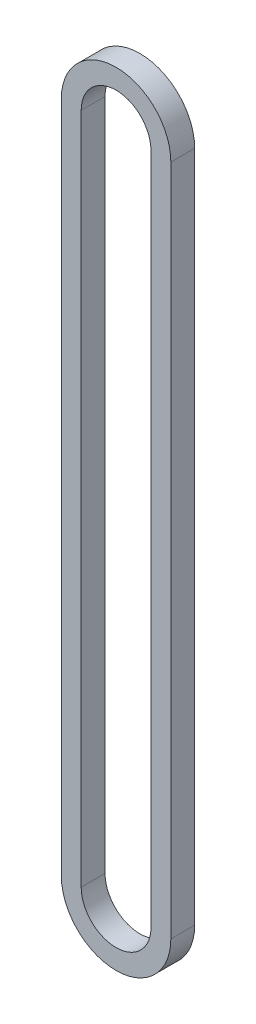
ISO-10303-21;
HEADER;
FILE_DESCRIPTION(('STEP AP214'),'2;1');
FILE_NAME('part.step','',(''),(''),'','','');
FILE_SCHEMA(('AUTOMOTIVE_DESIGN { 1 0 10303 214 1 1 1 1 }'));
ENDSEC;
DATA;
#1=APPLICATION_CONTEXT('core data for automotive mechanical design processes');
#2=APPLICATION_PROTOCOL_DEFINITION('international standard','automotive_design',2000,#1);
#3=PRODUCT_CONTEXT('',#1,'mechanical');
#4=PRODUCT('Part','Part','',(#3));
#5=PRODUCT_RELATED_PRODUCT_CATEGORY('part','',(#4));
#6=PRODUCT_DEFINITION_FORMATION('','',#4);
#7=PRODUCT_DEFINITION_CONTEXT('part definition',#1,'design');
#8=PRODUCT_DEFINITION('design','',#6,#7);
#9=PRODUCT_DEFINITION_SHAPE('','',#8);
#10=(LENGTH_UNIT() NAMED_UNIT(*) SI_UNIT(.MILLI.,.METRE.));
#11=(NAMED_UNIT(*) PLANE_ANGLE_UNIT() SI_UNIT($,.RADIAN.));
#12=(NAMED_UNIT(*) SI_UNIT($,.STERADIAN.) SOLID_ANGLE_UNIT());
#13=UNCERTAINTY_MEASURE_WITH_UNIT(LENGTH_MEASURE(1.E-05),#10,'distance_accuracy_value','');
#14=(GEOMETRIC_REPRESENTATION_CONTEXT(3) GLOBAL_UNCERTAINTY_ASSIGNED_CONTEXT((#13)) GLOBAL_UNIT_ASSIGNED_CONTEXT((#10,
#11,#12)) REPRESENTATION_CONTEXT('',''));
#15=CARTESIAN_POINT('',(0.,0.,0.));
#16=DIRECTION('',(0.,0.,1.));
#17=DIRECTION('',(1.,0.,0.));
#18=AXIS2_PLACEMENT_3D('',#15,#16,#17);
#19=CARTESIAN_POINT('',(0.,0.,7.62));
#20=DIRECTION('',(0.,0.,1.));
#21=DIRECTION('',(1.,0.,0.));
#22=AXIS2_PLACEMENT_3D('',#19,#20,#21);
#23=PLANE('',#22);
#24=CARTESIAN_POINT('',(0.,0.,7.62));
#25=DIRECTION('',(0.,0.,1.));
#26=DIRECTION('',(1.,0.,0.));
#27=AXIS2_PLACEMENT_3D('',#24,#25,#26);
#28=CIRCLE('',#27,17.5006);
#29=CARTESIAN_POINT('',(-17.5006,0.,7.62));
#30=VERTEX_POINT('',#29);
#31=CARTESIAN_POINT('',(17.5006,0.,7.62));
#32=VERTEX_POINT('',#31);
#33=EDGE_CURVE('E159',#30,#32,#28,.T.);
#34=ORIENTED_EDGE('',*,*,#33,.T.);
#35=DIRECTION('',(0.,1.,0.));
#36=VECTOR('',#35,1.);
#37=CARTESIAN_POINT('',(17.5006,0.,7.62));
#38=LINE('',#37,#36);
#39=CARTESIAN_POINT('',(17.5006,215.,7.62));
#40=VERTEX_POINT('',#39);
#41=EDGE_CURVE('E163',#32,#40,#38,.T.);
#42=ORIENTED_EDGE('',*,*,#41,.T.);
#43=CARTESIAN_POINT('',(0.,215.,7.62));
#44=DIRECTION('',(0.,0.,1.));
#45=DIRECTION('',(1.,0.,0.));
#46=AXIS2_PLACEMENT_3D('',#43,#44,#45);
#47=CIRCLE('',#46,17.5006);
#48=CARTESIAN_POINT('',(-17.5006,215.,7.62));
#49=VERTEX_POINT('',#48);
#50=EDGE_CURVE('E167',#40,#49,#47,.T.);
#51=ORIENTED_EDGE('',*,*,#50,.T.);
#52=DIRECTION('',(0.,-1.,0.));
#53=VECTOR('',#52,1.);
#54=CARTESIAN_POINT('',(-17.5006,0.,7.62));
#55=LINE('',#54,#53);
#56=EDGE_CURVE('E170',#49,#30,#55,.T.);
#57=ORIENTED_EDGE('',*,*,#56,.T.);
#58=EDGE_LOOP('',(#34,#42,#51,#57));
#59=FACE_BOUND('',#58,.T.);
#60=DIRECTION('',(0.,1.,0.));
#61=VECTOR('',#60,1.);
#62=CARTESIAN_POINT('',(11.1506,0.,7.62));
#63=LINE('',#62,#61);
#64=CARTESIAN_POINT('',(11.1506,0.,7.62));
#65=VERTEX_POINT('',#64);
#66=CARTESIAN_POINT('',(11.1506,215.,7.62));
#67=VERTEX_POINT('',#66);
#68=EDGE_CURVE('E120',#65,#67,#63,.T.);
#69=ORIENTED_EDGE('',*,*,#68,.F.);
#70=CARTESIAN_POINT('',(0.,0.,7.62));
#71=DIRECTION('',(0.,0.,1.));
#72=DIRECTION('',(1.,0.,0.));
#73=AXIS2_PLACEMENT_3D('',#70,#71,#72);
#74=CIRCLE('',#73,11.1506);
#75=CARTESIAN_POINT('',(-11.1506,0.,7.62));
#76=VERTEX_POINT('',#75);
#77=EDGE_CURVE('E111',#76,#65,#74,.T.);
#78=ORIENTED_EDGE('',*,*,#77,.F.);
#79=DIRECTION('',(0.,-1.,0.));
#80=VECTOR('',#79,1.);
#81=CARTESIAN_POINT('',(-11.1506,0.,7.62));
#82=LINE('',#81,#80);
#83=CARTESIAN_POINT('',(-11.1506,215.,7.62));
#84=VERTEX_POINT('',#83);
#85=EDGE_CURVE('E137',#84,#76,#82,.T.);
#86=ORIENTED_EDGE('',*,*,#85,.F.);
#87=CARTESIAN_POINT('',(0.,215.,7.62));
#88=DIRECTION('',(0.,0.,1.));
#89=DIRECTION('',(1.,0.,0.));
#90=AXIS2_PLACEMENT_3D('',#87,#88,#89);
#91=CIRCLE('',#90,11.1506);
#92=EDGE_CURVE('E133',#67,#84,#91,.T.);
#93=ORIENTED_EDGE('',*,*,#92,.F.);
#94=EDGE_LOOP('',(#69,#78,#86,#93));
#95=FACE_BOUND('',#94,.T.);
#96=ADVANCED_FACE('F45',(#59,#95),#23,.T.);
#97=CARTESIAN_POINT('',(0.,0.,0.));
#98=DIRECTION('',(0.,0.,1.));
#99=DIRECTION('',(1.,0.,0.));
#100=AXIS2_PLACEMENT_3D('',#97,#98,#99);
#101=PLANE('',#100);
#102=CARTESIAN_POINT('',(0.,0.,0.));
#103=DIRECTION('',(0.,0.,1.));
#104=DIRECTION('',(1.,0.,0.));
#105=AXIS2_PLACEMENT_3D('',#102,#103,#104);
#106=CIRCLE('',#105,17.5006);
#107=CARTESIAN_POINT('',(-17.5006,0.,0.));
#108=VERTEX_POINT('',#107);
#109=CARTESIAN_POINT('',(17.5006,0.,0.));
#110=VERTEX_POINT('',#109);
#111=EDGE_CURVE('E129',#108,#110,#106,.T.);
#112=ORIENTED_EDGE('',*,*,#111,.F.);
#113=DIRECTION('',(0.,-1.,0.));
#114=VECTOR('',#113,1.);
#115=CARTESIAN_POINT('',(-17.5006,0.,0.));
#116=LINE('',#115,#114);
#117=CARTESIAN_POINT('',(-17.5006,215.,0.));
#118=VERTEX_POINT('',#117);
#119=EDGE_CURVE('E164',#118,#108,#116,.T.);
#120=ORIENTED_EDGE('',*,*,#119,.F.);
#121=CARTESIAN_POINT('',(0.,215.,0.));
#122=DIRECTION('',(0.,0.,1.));
#123=DIRECTION('',(1.,0.,0.));
#124=AXIS2_PLACEMENT_3D('',#121,#122,#123);
#125=CIRCLE('',#124,17.5006);
#126=CARTESIAN_POINT('',(17.5006,215.,0.));
#127=VERTEX_POINT('',#126);
#128=EDGE_CURVE('E180',#127,#118,#125,.T.);
#129=ORIENTED_EDGE('',*,*,#128,.F.);
#130=DIRECTION('',(0.,1.,0.));
#131=VECTOR('',#130,1.);
#132=CARTESIAN_POINT('',(17.5006,0.,0.));
#133=LINE('',#132,#131);
#134=EDGE_CURVE('E177',#110,#127,#133,.T.);
#135=ORIENTED_EDGE('',*,*,#134,.F.);
#136=EDGE_LOOP('',(#112,#120,#129,#135));
#137=FACE_BOUND('',#136,.T.);
#138=CARTESIAN_POINT('',(0.,0.,0.));
#139=DIRECTION('',(0.,0.,1.));
#140=DIRECTION('',(1.,0.,0.));
#141=AXIS2_PLACEMENT_3D('',#138,#139,#140);
#142=CIRCLE('',#141,11.1506);
#143=CARTESIAN_POINT('',(-11.1506,0.,0.));
#144=VERTEX_POINT('',#143);
#145=CARTESIAN_POINT('',(11.1506,0.,0.));
#146=VERTEX_POINT('',#145);
#147=EDGE_CURVE('E69',#144,#146,#142,.T.);
#148=ORIENTED_EDGE('',*,*,#147,.T.);
#149=DIRECTION('',(0.,1.,0.));
#150=VECTOR('',#149,1.);
#151=CARTESIAN_POINT('',(11.1506,0.,0.));
#152=LINE('',#151,#150);
#153=CARTESIAN_POINT('',(11.1506,215.,0.));
#154=VERTEX_POINT('',#153);
#155=EDGE_CURVE('E127',#146,#154,#152,.T.);
#156=ORIENTED_EDGE('',*,*,#155,.T.);
#157=CARTESIAN_POINT('',(0.,215.,0.));
#158=DIRECTION('',(0.,0.,1.));
#159=DIRECTION('',(1.,0.,0.));
#160=AXIS2_PLACEMENT_3D('',#157,#158,#159);
#161=CIRCLE('',#160,11.1506);
#162=CARTESIAN_POINT('',(-11.1506,215.,0.));
#163=VERTEX_POINT('',#162);
#164=EDGE_CURVE('E146',#154,#163,#161,.T.);
#165=ORIENTED_EDGE('',*,*,#164,.T.);
#166=DIRECTION('',(0.,-1.,0.));
#167=VECTOR('',#166,1.);
#168=CARTESIAN_POINT('',(-11.1506,0.,0.));
#169=LINE('',#168,#167);
#170=EDGE_CURVE('E121',#163,#144,#169,.T.);
#171=ORIENTED_EDGE('',*,*,#170,.T.);
#172=EDGE_LOOP('',(#148,#156,#165,#171));
#173=FACE_BOUND('',#172,.T.);
#174=ADVANCED_FACE('F203',(#137,#173),#101,.F.);
#175=CARTESIAN_POINT('',(0.,0.,7.62));
#176=DIRECTION('',(0.,0.,-1.));
#177=DIRECTION('',(-1.,0.,0.));
#178=AXIS2_PLACEMENT_3D('',#175,#176,#177);
#179=CYLINDRICAL_SURFACE('',#178,17.5006);
#180=ORIENTED_EDGE('',*,*,#111,.T.);
#181=DIRECTION('',(0.,0.,-1.));
#182=VECTOR('',#181,1.);
#183=CARTESIAN_POINT('',(17.5006,0.,7.62));
#184=LINE('',#183,#182);
#185=EDGE_CURVE('E11',#32,#110,#184,.T.);
#186=ORIENTED_EDGE('',*,*,#185,.F.);
#187=ORIENTED_EDGE('',*,*,#33,.F.);
#188=DIRECTION('',(0.,0.,-1.));
#189=VECTOR('',#188,1.);
#190=CARTESIAN_POINT('',(-17.5006,0.,7.62));
#191=LINE('',#190,#189);
#192=EDGE_CURVE('E173',#30,#108,#191,.T.);
#193=ORIENTED_EDGE('',*,*,#192,.T.);
#194=EDGE_LOOP('',(#180,#186,#187,#193));
#195=FACE_BOUND('',#194,.T.);
#196=ADVANCED_FACE('F47',(#195),#179,.T.);
#197=CARTESIAN_POINT('',(17.5006,0.,7.62));
#198=DIRECTION('',(-1.,0.,0.));
#199=DIRECTION('',(0.,0.,1.));
#200=AXIS2_PLACEMENT_3D('',#197,#198,#199);
#201=PLANE('',#200);
#202=ORIENTED_EDGE('',*,*,#134,.T.);
#203=DIRECTION('',(0.,0.,-1.));
#204=VECTOR('',#203,1.);
#205=CARTESIAN_POINT('',(17.5006,215.,7.62));
#206=LINE('',#205,#204);
#207=EDGE_CURVE('E54',#40,#127,#206,.T.);
#208=ORIENTED_EDGE('',*,*,#207,.F.);
#209=ORIENTED_EDGE('',*,*,#41,.F.);
#210=ORIENTED_EDGE('',*,*,#185,.T.);
#211=EDGE_LOOP('',(#202,#208,#209,#210));
#212=FACE_BOUND('',#211,.T.);
#213=ADVANCED_FACE('F213',(#212),#201,.F.);
#214=CARTESIAN_POINT('',(0.,215.,7.62));
#215=DIRECTION('',(0.,0.,-1.));
#216=DIRECTION('',(-1.,0.,0.));
#217=AXIS2_PLACEMENT_3D('',#214,#215,#216);
#218=CYLINDRICAL_SURFACE('',#217,17.5006);
#219=ORIENTED_EDGE('',*,*,#128,.T.);
#220=DIRECTION('',(0.,0.,-1.));
#221=VECTOR('',#220,1.);
#222=CARTESIAN_POINT('',(-17.5006,215.,7.62));
#223=LINE('',#222,#221);
#224=EDGE_CURVE('E188',#49,#118,#223,.T.);
#225=ORIENTED_EDGE('',*,*,#224,.F.);
#226=ORIENTED_EDGE('',*,*,#50,.F.);
#227=ORIENTED_EDGE('',*,*,#207,.T.);
#228=EDGE_LOOP('',(#219,#225,#226,#227));
#229=FACE_BOUND('',#228,.T.);
#230=ADVANCED_FACE('F197',(#229),#218,.T.);
#231=CARTESIAN_POINT('',(-17.5006,0.,7.62));
#232=DIRECTION('',(1.,0.,0.));
#233=DIRECTION('',(0.,0.,-1.));
#234=AXIS2_PLACEMENT_3D('',#231,#232,#233);
#235=PLANE('',#234);
#236=ORIENTED_EDGE('',*,*,#119,.T.);
#237=ORIENTED_EDGE('',*,*,#192,.F.);
#238=ORIENTED_EDGE('',*,*,#56,.F.);
#239=ORIENTED_EDGE('',*,*,#224,.T.);
#240=EDGE_LOOP('',(#236,#237,#238,#239));
#241=FACE_BOUND('',#240,.T.);
#242=ADVANCED_FACE('F207',(#241),#235,.F.);
#243=CARTESIAN_POINT('',(0.,0.,7.62));
#244=DIRECTION('',(0.,0.,-1.));
#245=DIRECTION('',(-1.,0.,0.));
#246=AXIS2_PLACEMENT_3D('',#243,#244,#245);
#247=CYLINDRICAL_SURFACE('',#246,11.1506);
#248=ORIENTED_EDGE('',*,*,#147,.F.);
#249=DIRECTION('',(0.,0.,-1.));
#250=VECTOR('',#249,1.);
#251=CARTESIAN_POINT('',(-11.1506,0.,7.62));
#252=LINE('',#251,#250);
#253=EDGE_CURVE('E115',#76,#144,#252,.T.);
#254=ORIENTED_EDGE('',*,*,#253,.F.);
#255=ORIENTED_EDGE('',*,*,#77,.T.);
#256=DIRECTION('',(0.,0.,-1.));
#257=VECTOR('',#256,1.);
#258=CARTESIAN_POINT('',(11.1506,0.,7.62));
#259=LINE('',#258,#257);
#260=EDGE_CURVE('E114',#65,#146,#259,.T.);
#261=ORIENTED_EDGE('',*,*,#260,.T.);
#262=EDGE_LOOP('',(#248,#254,#255,#261));
#263=FACE_BOUND('',#262,.T.);
#264=ADVANCED_FACE('F113',(#263),#247,.F.);
#265=CARTESIAN_POINT('',(11.1506,0.,7.62));
#266=DIRECTION('',(-1.,0.,0.));
#267=DIRECTION('',(0.,0.,1.));
#268=AXIS2_PLACEMENT_3D('',#265,#266,#267);
#269=PLANE('',#268);
#270=ORIENTED_EDGE('',*,*,#155,.F.);
#271=ORIENTED_EDGE('',*,*,#260,.F.);
#272=ORIENTED_EDGE('',*,*,#68,.T.);
#273=DIRECTION('',(0.,0.,-1.));
#274=VECTOR('',#273,1.);
#275=CARTESIAN_POINT('',(11.1506,215.,7.62));
#276=LINE('',#275,#274);
#277=EDGE_CURVE('E130',#67,#154,#276,.T.);
#278=ORIENTED_EDGE('',*,*,#277,.T.);
#279=EDGE_LOOP('',(#270,#271,#272,#278));
#280=FACE_BOUND('',#279,.T.);
#281=ADVANCED_FACE('F124',(#280),#269,.T.);
#282=CARTESIAN_POINT('',(0.,215.,7.62));
#283=DIRECTION('',(0.,0.,-1.));
#284=DIRECTION('',(-1.,0.,0.));
#285=AXIS2_PLACEMENT_3D('',#282,#283,#284);
#286=CYLINDRICAL_SURFACE('',#285,11.1506);
#287=ORIENTED_EDGE('',*,*,#164,.F.);
#288=ORIENTED_EDGE('',*,*,#277,.F.);
#289=ORIENTED_EDGE('',*,*,#92,.T.);
#290=DIRECTION('',(0.,0.,-1.));
#291=VECTOR('',#290,1.);
#292=CARTESIAN_POINT('',(-11.1506,215.,7.62));
#293=LINE('',#292,#291);
#294=EDGE_CURVE('E61',#84,#163,#293,.T.);
#295=ORIENTED_EDGE('',*,*,#294,.T.);
#296=EDGE_LOOP('',(#287,#288,#289,#295));
#297=FACE_BOUND('',#296,.T.);
#298=ADVANCED_FACE('F236',(#297),#286,.F.);
#299=CARTESIAN_POINT('',(-11.1506,0.,7.62));
#300=DIRECTION('',(1.,0.,0.));
#301=DIRECTION('',(0.,0.,-1.));
#302=AXIS2_PLACEMENT_3D('',#299,#300,#301);
#303=PLANE('',#302);
#304=ORIENTED_EDGE('',*,*,#170,.F.);
#305=ORIENTED_EDGE('',*,*,#294,.F.);
#306=ORIENTED_EDGE('',*,*,#85,.T.);
#307=ORIENTED_EDGE('',*,*,#253,.T.);
#308=EDGE_LOOP('',(#304,#305,#306,#307));
#309=FACE_BOUND('',#308,.T.);
#310=ADVANCED_FACE('F240',(#309),#303,.T.);
#311=CLOSED_SHELL('',(#96,#174,#196,#213,#230,#242,#264,#281,#298,#310));
#312=MANIFOLD_SOLID_BREP('B2',#311);
#313=ADVANCED_BREP_SHAPE_REPRESENTATION('',(#18,#312),#14);
#314=SHAPE_DEFINITION_REPRESENTATION(#9,#313);
ENDSEC;
END-ISO-10303-21;
